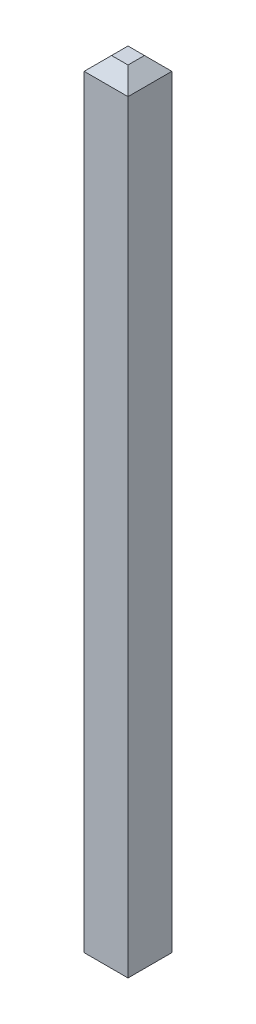
ISO-10303-21;
HEADER;
FILE_DESCRIPTION(('STEP AP214'),'2;1');
FILE_NAME('part.step','',(''),(''),'','','');
FILE_SCHEMA(('AUTOMOTIVE_DESIGN { 1 0 10303 214 1 1 1 1 }'));
ENDSEC;
DATA;
#1=APPLICATION_CONTEXT('core data for automotive mechanical design processes');
#2=APPLICATION_PROTOCOL_DEFINITION('international standard','automotive_design',2000,#1);
#3=PRODUCT_CONTEXT('',#1,'mechanical');
#4=PRODUCT('Part','Part','',(#3));
#5=PRODUCT_RELATED_PRODUCT_CATEGORY('part','',(#4));
#6=PRODUCT_DEFINITION_FORMATION('','',#4);
#7=PRODUCT_DEFINITION_CONTEXT('part definition',#1,'design');
#8=PRODUCT_DEFINITION('design','',#6,#7);
#9=PRODUCT_DEFINITION_SHAPE('','',#8);
#10=(LENGTH_UNIT() NAMED_UNIT(*) SI_UNIT(.MILLI.,.METRE.));
#11=(NAMED_UNIT(*) PLANE_ANGLE_UNIT() SI_UNIT($,.RADIAN.));
#12=(NAMED_UNIT(*) SI_UNIT($,.STERADIAN.) SOLID_ANGLE_UNIT());
#13=UNCERTAINTY_MEASURE_WITH_UNIT(LENGTH_MEASURE(1.E-05),#10,'distance_accuracy_value','');
#14=(GEOMETRIC_REPRESENTATION_CONTEXT(3) GLOBAL_UNCERTAINTY_ASSIGNED_CONTEXT((#13)) GLOBAL_UNIT_ASSIGNED_CONTEXT((#10,
#11,#12)) REPRESENTATION_CONTEXT('',''));
#15=CARTESIAN_POINT('',(0.,0.,0.));
#16=DIRECTION('',(0.,0.,1.));
#17=DIRECTION('',(1.,0.,0.));
#18=AXIS2_PLACEMENT_3D('',#15,#16,#17);
#19=CARTESIAN_POINT('',(-0.95,7.07,-0.32));
#20=DIRECTION('',(-0.707106781186548,-0.707106781186548,0.));
#21=DIRECTION('',(-0.707106781186548,0.707106781186548,0.));
#22=AXIS2_PLACEMENT_3D('',#19,#20,#21);
#23=PLANE('',#22);
#24=DIRECTION('',(0.577350269189626,-0.577350269189626,0.577350269189626));
#25=VECTOR('',#24,1.);
#26=CARTESIAN_POINT('',(-1.163333333333,7.283333333333,0.106666666667));
#27=LINE('',#26,#25);
#28=CARTESIAN_POINT('',(-1.15,7.27,0.12));
#29=VERTEX_POINT('',#28);
#30=CARTESIAN_POINT('',(-0.95,7.07,0.32));
#31=VERTEX_POINT('',#30);
#32=EDGE_CURVE('E60',#29,#31,#27,.T.);
#33=ORIENTED_EDGE('',*,*,#32,.T.);
#34=DIRECTION('',(0.,0.,1.));
#35=VECTOR('',#34,1.);
#36=CARTESIAN_POINT('',(-0.95,7.07,-0.32));
#37=LINE('',#36,#35);
#38=CARTESIAN_POINT('',(-0.95,7.07,-0.32));
#39=VERTEX_POINT('',#38);
#40=EDGE_CURVE('E107',#39,#31,#37,.T.);
#41=ORIENTED_EDGE('',*,*,#40,.F.);
#42=DIRECTION('',(0.577350269189626,-0.577350269189626,-0.577350269189626));
#43=VECTOR('',#42,1.);
#44=CARTESIAN_POINT('',(-0.95,7.07,-0.32));
#45=LINE('',#44,#43);
#46=CARTESIAN_POINT('',(-1.15,7.27,-0.12));
#47=VERTEX_POINT('',#46);
#48=EDGE_CURVE('E11',#47,#39,#45,.T.);
#49=ORIENTED_EDGE('',*,*,#48,.F.);
#50=DIRECTION('',(0.,0.,-1.));
#51=VECTOR('',#50,1.);
#52=CARTESIAN_POINT('',(-1.15,7.27,-0.32));
#53=LINE('',#52,#51);
#54=EDGE_CURVE('E148',#29,#47,#53,.T.);
#55=ORIENTED_EDGE('',*,*,#54,.F.);
#56=EDGE_LOOP('',(#33,#41,#49,#55));
#57=FACE_BOUND('',#56,.T.);
#58=ADVANCED_FACE('F17',(#57),#23,.F.);
#59=CARTESIAN_POINT('',(-1.27,7.07,-0.32));
#60=DIRECTION('',(0.,0.707106781186548,-0.707106781186548));
#61=DIRECTION('',(-1.,0.,0.));
#62=AXIS2_PLACEMENT_3D('',#59,#60,#61);
#63=PLANE('',#62);
#64=DIRECTION('',(0.577350269189626,0.577350269189626,0.577350269189626));
#65=VECTOR('',#64,1.);
#66=CARTESIAN_POINT('',(-1.456666666667,7.203333333333,-0.186666666667));
#67=LINE('',#66,#65);
#68=CARTESIAN_POINT('',(-1.59,7.07,-0.32));
#69=VERTEX_POINT('',#68);
#70=CARTESIAN_POINT('',(-1.39,7.27,-0.12));
#71=VERTEX_POINT('',#70);
#72=EDGE_CURVE('E27',#69,#71,#67,.T.);
#73=ORIENTED_EDGE('',*,*,#72,.T.);
#74=DIRECTION('',(-1.,0.,0.));
#75=VECTOR('',#74,1.);
#76=CARTESIAN_POINT('',(-1.59,7.27,-0.12));
#77=LINE('',#76,#75);
#78=EDGE_CURVE('E152',#47,#71,#77,.T.);
#79=ORIENTED_EDGE('',*,*,#78,.F.);
#80=ORIENTED_EDGE('',*,*,#48,.T.);
#81=DIRECTION('',(1.,0.,0.));
#82=VECTOR('',#81,1.);
#83=CARTESIAN_POINT('',(-0.95,7.07,-0.32));
#84=LINE('',#83,#82);
#85=EDGE_CURVE('E129',#69,#39,#84,.T.);
#86=ORIENTED_EDGE('',*,*,#85,.F.);
#87=EDGE_LOOP('',(#73,#79,#80,#86));
#88=FACE_BOUND('',#87,.T.);
#89=ADVANCED_FACE('F19',(#88),#63,.T.);
#90=CARTESIAN_POINT('',(-1.39,7.27,-0.32));
#91=DIRECTION('',(0.707106781186548,-0.707106781186548,0.));
#92=DIRECTION('',(0.,0.,-1.));
#93=AXIS2_PLACEMENT_3D('',#90,#91,#92);
#94=PLANE('',#93);
#95=DIRECTION('',(-0.577350269189626,-0.577350269189626,0.577350269189626));
#96=VECTOR('',#95,1.);
#97=CARTESIAN_POINT('',(-1.456666666667,7.203333333333,0.186666666667));
#98=LINE('',#97,#96);
#99=CARTESIAN_POINT('',(-1.39,7.27,0.12));
#100=VERTEX_POINT('',#99);
#101=CARTESIAN_POINT('',(-1.59,7.07,0.32));
#102=VERTEX_POINT('',#101);
#103=EDGE_CURVE('E39',#100,#102,#98,.T.);
#104=ORIENTED_EDGE('',*,*,#103,.F.);
#105=DIRECTION('',(0.,0.,1.));
#106=VECTOR('',#105,1.);
#107=CARTESIAN_POINT('',(-1.39,7.27,-0.32));
#108=LINE('',#107,#106);
#109=EDGE_CURVE('E156',#71,#100,#108,.T.);
#110=ORIENTED_EDGE('',*,*,#109,.F.);
#111=ORIENTED_EDGE('',*,*,#72,.F.);
#112=DIRECTION('',(0.,0.,-1.));
#113=VECTOR('',#112,1.);
#114=CARTESIAN_POINT('',(-1.59,7.07,-0.32));
#115=LINE('',#114,#113);
#116=EDGE_CURVE('E111',#102,#69,#115,.T.);
#117=ORIENTED_EDGE('',*,*,#116,.F.);
#118=EDGE_LOOP('',(#104,#110,#111,#117));
#119=FACE_BOUND('',#118,.T.);
#120=ADVANCED_FACE('F112',(#119),#94,.F.);
#121=CARTESIAN_POINT('',(-1.59,7.27,0.12));
#122=DIRECTION('',(0.,-0.707106781186548,-0.707106781186548));
#123=DIRECTION('',(0.,-0.707106781186548,0.707106781186548));
#124=AXIS2_PLACEMENT_3D('',#121,#122,#123);
#125=PLANE('',#124);
#126=ORIENTED_EDGE('',*,*,#32,.F.);
#127=DIRECTION('',(1.,0.,0.));
#128=VECTOR('',#127,1.);
#129=CARTESIAN_POINT('',(-1.59,7.27,0.12));
#130=LINE('',#129,#128);
#131=EDGE_CURVE('E95',#100,#29,#130,.T.);
#132=ORIENTED_EDGE('',*,*,#131,.F.);
#133=ORIENTED_EDGE('',*,*,#103,.T.);
#134=DIRECTION('',(-1.,0.,0.));
#135=VECTOR('',#134,1.);
#136=CARTESIAN_POINT('',(-1.27,7.07,0.32));
#137=LINE('',#136,#135);
#138=EDGE_CURVE('E93',#31,#102,#137,.T.);
#139=ORIENTED_EDGE('',*,*,#138,.F.);
#140=EDGE_LOOP('',(#126,#132,#133,#139));
#141=FACE_BOUND('',#140,.T.);
#142=ADVANCED_FACE('F92',(#141),#125,.F.);
#143=CARTESIAN_POINT('',(-1.59,7.27,-0.32));
#144=DIRECTION('',(0.,-1.,0.));
#145=DIRECTION('',(0.,0.,-1.));
#146=AXIS2_PLACEMENT_3D('',#143,#144,#145);
#147=PLANE('',#146);
#148=ORIENTED_EDGE('',*,*,#54,.T.);
#149=ORIENTED_EDGE('',*,*,#78,.T.);
#150=ORIENTED_EDGE('',*,*,#109,.T.);
#151=ORIENTED_EDGE('',*,*,#131,.T.);
#152=EDGE_LOOP('',(#148,#149,#150,#151));
#153=FACE_BOUND('',#152,.T.);
#154=ADVANCED_FACE('F289',(#153),#147,.F.);
#155=CARTESIAN_POINT('',(-0.95,7.27,-0.32));
#156=DIRECTION('',(-1.,0.,0.));
#157=DIRECTION('',(0.,1.,0.));
#158=AXIS2_PLACEMENT_3D('',#155,#156,#157);
#159=PLANE('',#158);
#160=DIRECTION('',(0.,-1.,0.));
#161=VECTOR('',#160,1.);
#162=CARTESIAN_POINT('',(-0.95,7.27,-0.32));
#163=LINE('',#162,#161);
#164=CARTESIAN_POINT('',(-0.95,-4.07,-0.32));
#165=VERTEX_POINT('',#164);
#166=EDGE_CURVE('E122',#39,#165,#163,.T.);
#167=ORIENTED_EDGE('',*,*,#166,.F.);
#168=ORIENTED_EDGE('',*,*,#40,.T.);
#169=DIRECTION('',(0.,-1.,0.));
#170=VECTOR('',#169,1.);
#171=CARTESIAN_POINT('',(-0.95,7.27,0.32));
#172=LINE('',#171,#170);
#173=CARTESIAN_POINT('',(-0.95,-4.07,0.32));
#174=VERTEX_POINT('',#173);
#175=EDGE_CURVE('E105',#31,#174,#172,.T.);
#176=ORIENTED_EDGE('',*,*,#175,.T.);
#177=DIRECTION('',(0.,0.,-1.));
#178=VECTOR('',#177,1.);
#179=CARTESIAN_POINT('',(-0.95,-4.07,-0.32));
#180=LINE('',#179,#178);
#181=EDGE_CURVE('E141',#174,#165,#180,.T.);
#182=ORIENTED_EDGE('',*,*,#181,.T.);
#183=EDGE_LOOP('',(#167,#168,#176,#182));
#184=FACE_BOUND('',#183,.T.);
#185=ADVANCED_FACE('F331',(#184),#159,.F.);
#186=CARTESIAN_POINT('',(-1.27,1.5,0.32));
#187=DIRECTION('',(0.,0.,-1.));
#188=DIRECTION('',(0.,-1.,0.));
#189=AXIS2_PLACEMENT_3D('',#186,#187,#188);
#190=PLANE('',#189);
#191=ORIENTED_EDGE('',*,*,#175,.F.);
#192=ORIENTED_EDGE('',*,*,#138,.T.);
#193=DIRECTION('',(0.,1.,0.));
#194=VECTOR('',#193,1.);
#195=CARTESIAN_POINT('',(-1.59,-4.27,0.32));
#196=LINE('',#195,#194);
#197=CARTESIAN_POINT('',(-1.59,-4.07,0.32));
#198=VERTEX_POINT('',#197);
#199=EDGE_CURVE('E104',#198,#102,#196,.T.);
#200=ORIENTED_EDGE('',*,*,#199,.F.);
#201=DIRECTION('',(1.,0.,0.));
#202=VECTOR('',#201,1.);
#203=CARTESIAN_POINT('',(-1.27,-4.07,0.32));
#204=LINE('',#203,#202);
#205=EDGE_CURVE('E137',#198,#174,#204,.T.);
#206=ORIENTED_EDGE('',*,*,#205,.T.);
#207=EDGE_LOOP('',(#191,#192,#200,#206));
#208=FACE_BOUND('',#207,.T.);
#209=ADVANCED_FACE('F101',(#208),#190,.F.);
#210=CARTESIAN_POINT('',(-1.15,-4.27,-0.32));
#211=DIRECTION('',(-0.707106781186548,0.707106781186548,0.));
#212=DIRECTION('',(0.,0.,1.));
#213=AXIS2_PLACEMENT_3D('',#210,#211,#212);
#214=PLANE('',#213);
#215=DIRECTION('',(-0.577350269189626,-0.577350269189626,0.577350269189626));
#216=VECTOR('',#215,1.);
#217=CARTESIAN_POINT('',(-1.083333333333,-4.203333333333,-0.186666666667));
#218=LINE('',#217,#216);
#219=CARTESIAN_POINT('',(-1.15,-4.27,-0.12));
#220=VERTEX_POINT('',#219);
#221=EDGE_CURVE('E230',#165,#220,#218,.T.);
#222=ORIENTED_EDGE('',*,*,#221,.F.);
#223=ORIENTED_EDGE('',*,*,#181,.F.);
#224=DIRECTION('',(-0.577350269189626,-0.577350269189626,-0.577350269189626));
#225=VECTOR('',#224,1.);
#226=CARTESIAN_POINT('',(-1.296666666667,-4.416666666667,-0.02666666666667));
#227=LINE('',#226,#225);
#228=CARTESIAN_POINT('',(-1.15,-4.27,0.12));
#229=VERTEX_POINT('',#228);
#230=EDGE_CURVE('E133',#174,#229,#227,.T.);
#231=ORIENTED_EDGE('',*,*,#230,.T.);
#232=DIRECTION('',(0.,0.,1.));
#233=VECTOR('',#232,1.);
#234=CARTESIAN_POINT('',(-1.15,-4.27,-0.32));
#235=LINE('',#234,#233);
#236=EDGE_CURVE('E274',#220,#229,#235,.T.);
#237=ORIENTED_EDGE('',*,*,#236,.F.);
#238=EDGE_LOOP('',(#222,#223,#231,#237));
#239=FACE_BOUND('',#238,.T.);
#240=ADVANCED_FACE('F320',(#239),#214,.F.);
#241=CARTESIAN_POINT('',(-0.95,-4.27,0.12));
#242=DIRECTION('',(0.,0.707106781186548,-0.707106781186548));
#243=DIRECTION('',(-1.,0.,0.));
#244=AXIS2_PLACEMENT_3D('',#241,#242,#243);
#245=PLANE('',#244);
#246=ORIENTED_EDGE('',*,*,#230,.F.);
#247=ORIENTED_EDGE('',*,*,#205,.F.);
#248=DIRECTION('',(-0.577350269189626,0.577350269189626,0.577350269189626));
#249=VECTOR('',#248,1.);
#250=CARTESIAN_POINT('',(-1.376666666667,-4.283333333333,0.106666666667));
#251=LINE('',#250,#249);
#252=CARTESIAN_POINT('',(-1.39,-4.27,0.12));
#253=VERTEX_POINT('',#252);
#254=EDGE_CURVE('E138',#253,#198,#251,.T.);
#255=ORIENTED_EDGE('',*,*,#254,.F.);
#256=DIRECTION('',(-1.,0.,0.));
#257=VECTOR('',#256,1.);
#258=CARTESIAN_POINT('',(-0.95,-4.27,0.12));
#259=LINE('',#258,#257);
#260=EDGE_CURVE('E266',#229,#253,#259,.T.);
#261=ORIENTED_EDGE('',*,*,#260,.F.);
#262=EDGE_LOOP('',(#246,#247,#255,#261));
#263=FACE_BOUND('',#262,.T.);
#264=ADVANCED_FACE('F322',(#263),#245,.F.);
#265=CARTESIAN_POINT('',(-1.59,-4.07,-0.32));
#266=DIRECTION('',(0.707106781186548,0.707106781186548,0.));
#267=DIRECTION('',(0.,0.,-1.));
#268=AXIS2_PLACEMENT_3D('',#265,#266,#267);
#269=PLANE('',#268);
#270=DIRECTION('',(0.577350269189626,-0.577350269189626,0.577350269189626));
#271=VECTOR('',#270,1.);
#272=CARTESIAN_POINT('',(-1.483333333333,-4.176666666667,-0.213333333333));
#273=LINE('',#272,#271);
#274=CARTESIAN_POINT('',(-1.59,-4.07,-0.32));
#275=VERTEX_POINT('',#274);
#276=CARTESIAN_POINT('',(-1.39,-4.27,-0.12));
#277=VERTEX_POINT('',#276);
#278=EDGE_CURVE('E244',#275,#277,#273,.T.);
#279=ORIENTED_EDGE('',*,*,#278,.T.);
#280=DIRECTION('',(0.,0.,-1.));
#281=VECTOR('',#280,1.);
#282=CARTESIAN_POINT('',(-1.39,-4.27,-0.32));
#283=LINE('',#282,#281);
#284=EDGE_CURVE('E258',#253,#277,#283,.T.);
#285=ORIENTED_EDGE('',*,*,#284,.F.);
#286=ORIENTED_EDGE('',*,*,#254,.T.);
#287=DIRECTION('',(0.,0.,1.));
#288=VECTOR('',#287,1.);
#289=CARTESIAN_POINT('',(-1.59,-4.07,-0.32));
#290=LINE('',#289,#288);
#291=EDGE_CURVE('E117',#275,#198,#290,.T.);
#292=ORIENTED_EDGE('',*,*,#291,.F.);
#293=EDGE_LOOP('',(#279,#285,#286,#292));
#294=FACE_BOUND('',#293,.T.);
#295=ADVANCED_FACE('F329',(#294),#269,.F.);
#296=CARTESIAN_POINT('',(-1.59,-4.27,-0.32));
#297=DIRECTION('',(1.,0.,0.));
#298=DIRECTION('',(0.,0.,1.));
#299=AXIS2_PLACEMENT_3D('',#296,#297,#298);
#300=PLANE('',#299);
#301=ORIENTED_EDGE('',*,*,#199,.T.);
#302=ORIENTED_EDGE('',*,*,#116,.T.);
#303=DIRECTION('',(0.,1.,0.));
#304=VECTOR('',#303,1.);
#305=CARTESIAN_POINT('',(-1.59,-4.27,-0.32));
#306=LINE('',#305,#304);
#307=EDGE_CURVE('E223',#275,#69,#306,.T.);
#308=ORIENTED_EDGE('',*,*,#307,.F.);
#309=ORIENTED_EDGE('',*,*,#291,.T.);
#310=EDGE_LOOP('',(#301,#302,#308,#309));
#311=FACE_BOUND('',#310,.T.);
#312=ADVANCED_FACE('F120',(#311),#300,.F.);
#313=CARTESIAN_POINT('',(-1.27,1.5,-0.32));
#314=DIRECTION('',(0.,0.,-1.));
#315=DIRECTION('',(0.,-1.,0.));
#316=AXIS2_PLACEMENT_3D('',#313,#314,#315);
#317=PLANE('',#316);
#318=ORIENTED_EDGE('',*,*,#307,.T.);
#319=ORIENTED_EDGE('',*,*,#85,.T.);
#320=ORIENTED_EDGE('',*,*,#166,.T.);
#321=DIRECTION('',(-1.,0.,0.));
#322=VECTOR('',#321,1.);
#323=CARTESIAN_POINT('',(-1.59,-4.07,-0.32));
#324=LINE('',#323,#322);
#325=EDGE_CURVE('E237',#165,#275,#324,.T.);
#326=ORIENTED_EDGE('',*,*,#325,.T.);
#327=EDGE_LOOP('',(#318,#319,#320,#326));
#328=FACE_BOUND('',#327,.T.);
#329=ADVANCED_FACE('F342',(#328),#317,.T.);
#330=CARTESIAN_POINT('',(-1.27,-4.07,-0.32));
#331=DIRECTION('',(0.,-0.707106781186548,-0.707106781186548));
#332=DIRECTION('',(0.,-0.707106781186548,0.707106781186548));
#333=AXIS2_PLACEMENT_3D('',#330,#331,#332);
#334=PLANE('',#333);
#335=ORIENTED_EDGE('',*,*,#278,.F.);
#336=ORIENTED_EDGE('',*,*,#325,.F.);
#337=ORIENTED_EDGE('',*,*,#221,.T.);
#338=DIRECTION('',(1.,0.,0.));
#339=VECTOR('',#338,1.);
#340=CARTESIAN_POINT('',(-0.95,-4.27,-0.12));
#341=LINE('',#340,#339);
#342=EDGE_CURVE('E251',#277,#220,#341,.T.);
#343=ORIENTED_EDGE('',*,*,#342,.F.);
#344=EDGE_LOOP('',(#335,#336,#337,#343));
#345=FACE_BOUND('',#344,.T.);
#346=ADVANCED_FACE('F318',(#345),#334,.T.);
#347=CARTESIAN_POINT('',(-0.95,-4.27,-0.32));
#348=DIRECTION('',(0.,1.,0.));
#349=DIRECTION('',(0.,0.,-1.));
#350=AXIS2_PLACEMENT_3D('',#347,#348,#349);
#351=PLANE('',#350);
#352=ORIENTED_EDGE('',*,*,#236,.T.);
#353=ORIENTED_EDGE('',*,*,#260,.T.);
#354=ORIENTED_EDGE('',*,*,#284,.T.);
#355=ORIENTED_EDGE('',*,*,#342,.T.);
#356=EDGE_LOOP('',(#352,#353,#354,#355));
#357=FACE_BOUND('',#356,.T.);
#358=ADVANCED_FACE('F319',(#357),#351,.F.);
#359=CLOSED_SHELL('',(#58,#89,#120,#142,#154,#185,#209,#240,#264,#295,#312,#329,#346,#358));
#360=MANIFOLD_SOLID_BREP('B1',#359);
#361=ADVANCED_BREP_SHAPE_REPRESENTATION('',(#18,#360),#14);
#362=SHAPE_DEFINITION_REPRESENTATION(#9,#361);
ENDSEC;
END-ISO-10303-21;
